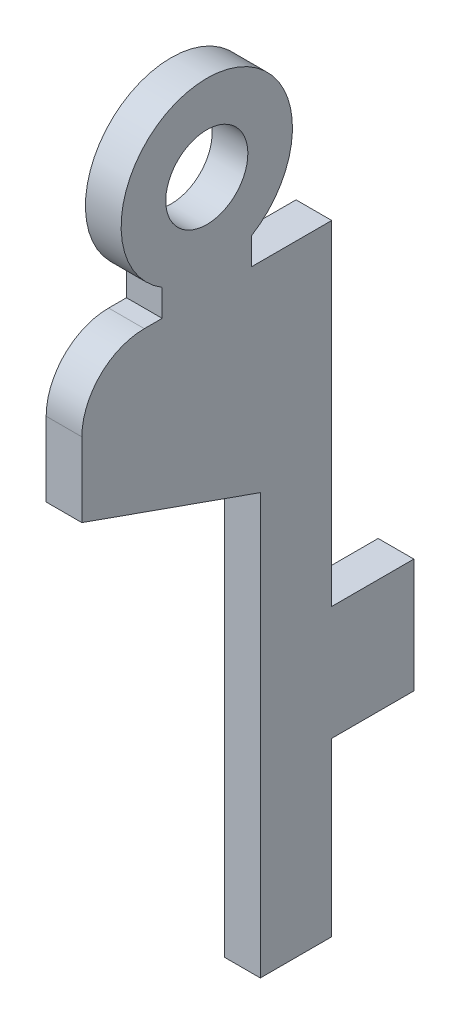
ISO-10303-21;
HEADER;
FILE_DESCRIPTION(('STEP AP214'),'2;1');
FILE_NAME('part.step','',(''),(''),'','','');
FILE_SCHEMA(('AUTOMOTIVE_DESIGN { 1 0 10303 214 1 1 1 1 }'));
ENDSEC;
DATA;
#1=APPLICATION_CONTEXT('core data for automotive mechanical design processes');
#2=APPLICATION_PROTOCOL_DEFINITION('international standard','automotive_design',2000,#1);
#3=PRODUCT_CONTEXT('',#1,'mechanical');
#4=PRODUCT('Part','Part','',(#3));
#5=PRODUCT_RELATED_PRODUCT_CATEGORY('part','',(#4));
#6=PRODUCT_DEFINITION_FORMATION('','',#4);
#7=PRODUCT_DEFINITION_CONTEXT('part definition',#1,'design');
#8=PRODUCT_DEFINITION('design','',#6,#7);
#9=PRODUCT_DEFINITION_SHAPE('','',#8);
#10=(LENGTH_UNIT() NAMED_UNIT(*) SI_UNIT(.MILLI.,.METRE.));
#11=(NAMED_UNIT(*) PLANE_ANGLE_UNIT() SI_UNIT($,.RADIAN.));
#12=(NAMED_UNIT(*) SI_UNIT($,.STERADIAN.) SOLID_ANGLE_UNIT());
#13=UNCERTAINTY_MEASURE_WITH_UNIT(LENGTH_MEASURE(1.E-05),#10,'distance_accuracy_value','');
#14=(GEOMETRIC_REPRESENTATION_CONTEXT(3) GLOBAL_UNCERTAINTY_ASSIGNED_CONTEXT((#13)) GLOBAL_UNIT_ASSIGNED_CONTEXT((#10,
#11,#12)) REPRESENTATION_CONTEXT('',''));
#15=CARTESIAN_POINT('',(0.,0.,0.));
#16=DIRECTION('',(0.,0.,1.));
#17=DIRECTION('',(1.,0.,0.));
#18=AXIS2_PLACEMENT_3D('',#15,#16,#17);
#19=CARTESIAN_POINT('',(2.35,8.49175045506222,-7.7));
#20=DIRECTION('',(1.,0.,0.));
#21=DIRECTION('',(0.,1.,0.));
#22=AXIS2_PLACEMENT_3D('',#19,#20,#21);
#23=PLANE('',#22);
#24=CARTESIAN_POINT('',(2.35,17.3808325195312,-6.55));
#25=DIRECTION('',(1.,0.,0.));
#26=DIRECTION('',(0.,1.,0.));
#27=AXIS2_PLACEMENT_3D('',#24,#25,#26);
#28=CIRCLE('',#27,1.15);
#29=CARTESIAN_POINT('',(2.35,16.2308325195312,-6.55));
#30=VERTEX_POINT('',#29);
#31=EDGE_CURVE('E254',#30,#30,#28,.T.);
#32=ORIENTED_EDGE('',*,*,#31,.T.);
#33=EDGE_LOOP('',(#32));
#34=FACE_BOUND('',#33,.T.);
#35=DIRECTION('',(0.,-1.,0.));
#36=VECTOR('',#35,1.);
#37=CARTESIAN_POINT('',(2.35,2.01624877929678,-12.35));
#38=LINE('',#37,#36);
#39=CARTESIAN_POINT('',(2.35,5.21624877929677,-12.35));
#40=VERTEX_POINT('',#39);
#41=CARTESIAN_POINT('',(2.35,2.01624877929678,-12.35));
#42=VERTEX_POINT('',#41);
#43=EDGE_CURVE('E11',#40,#42,#38,.T.);
#44=ORIENTED_EDGE('',*,*,#43,.T.);
#45=DIRECTION('',(0.,0.,1.));
#46=VECTOR('',#45,1.);
#47=CARTESIAN_POINT('',(2.35,2.01624877929678,-12.35));
#48=LINE('',#47,#46);
#49=CARTESIAN_POINT('',(2.35,2.01624877929678,-10.05));
#50=VERTEX_POINT('',#49);
#51=EDGE_CURVE('E169',#42,#50,#48,.T.);
#52=ORIENTED_EDGE('',*,*,#51,.T.);
#53=DIRECTION('',(0.,-1.,0.));
#54=VECTOR('',#53,1.);
#55=CARTESIAN_POINT('',(2.35,2.01624877929678,-10.05));
#56=LINE('',#55,#54);
#57=CARTESIAN_POINT('',(2.35,-2.79733160940674,-10.05));
#58=VERTEX_POINT('',#57);
#59=EDGE_CURVE('E176',#50,#58,#56,.T.);
#60=ORIENTED_EDGE('',*,*,#59,.T.);
#61=DIRECTION('',(0.,0.,1.));
#62=VECTOR('',#61,1.);
#63=CARTESIAN_POINT('',(2.35,-2.79733160940674,-10.05));
#64=LINE('',#63,#62);
#65=CARTESIAN_POINT('',(2.35,-2.79733160940674,-8.05));
#66=VERTEX_POINT('',#65);
#67=EDGE_CURVE('E193',#58,#66,#64,.T.);
#68=ORIENTED_EDGE('',*,*,#67,.T.);
#69=DIRECTION('',(0.,1.,0.));
#70=VECTOR('',#69,1.);
#71=CARTESIAN_POINT('',(2.35,-2.79733160940674,-8.05));
#72=LINE('',#71,#70);
#73=CARTESIAN_POINT('',(2.35,8.97779600691296,-8.05));
#74=VERTEX_POINT('',#73);
#75=EDGE_CURVE('E274',#66,#74,#72,.T.);
#76=ORIENTED_EDGE('',*,*,#75,.T.);
#77=DIRECTION('',(0.,0.334004933719925,0.942571325816115));
#78=VECTOR('',#77,1.);
#79=CARTESIAN_POINT('',(2.35,10.7495713865148,-3.05));
#80=LINE('',#79,#78);
#81=CARTESIAN_POINT('',(2.35,10.7495713865148,-3.05));
#82=VERTEX_POINT('',#81);
#83=EDGE_CURVE('E214',#74,#82,#80,.T.);
#84=ORIENTED_EDGE('',*,*,#83,.T.);
#85=DIRECTION('',(0.,1.,0.));
#86=VECTOR('',#85,1.);
#87=CARTESIAN_POINT('',(2.35,10.7495713865148,-3.05));
#88=LINE('',#87,#86);
#89=CARTESIAN_POINT('',(2.35,12.8308325195312,-3.05));
#90=VERTEX_POINT('',#89);
#91=EDGE_CURVE('E21',#82,#90,#88,.T.);
#92=ORIENTED_EDGE('',*,*,#91,.T.);
#93=CARTESIAN_POINT('',(2.35,12.8308325195312,-4.8));
#94=DIRECTION('',(-1.,0.,0.));
#95=DIRECTION('',(0.,1.,0.));
#96=AXIS2_PLACEMENT_3D('',#93,#94,#95);
#97=CIRCLE('',#96,1.75);
#98=CARTESIAN_POINT('',(2.35,14.5808325195312,-4.8));
#99=VERTEX_POINT('',#98);
#100=EDGE_CURVE('E251',#90,#99,#97,.T.);
#101=ORIENTED_EDGE('',*,*,#100,.T.);
#102=DIRECTION('',(0.,0.,-1.));
#103=VECTOR('',#102,1.);
#104=CARTESIAN_POINT('',(2.35,14.5808325195312,-5.3));
#105=LINE('',#104,#103);
#106=CARTESIAN_POINT('',(2.35,14.5808325195312,-5.3));
#107=VERTEX_POINT('',#106);
#108=EDGE_CURVE('E292',#99,#107,#105,.T.);
#109=ORIENTED_EDGE('',*,*,#108,.T.);
#110=DIRECTION('',(0.,1.,0.));
#111=VECTOR('',#110,1.);
#112=CARTESIAN_POINT('',(2.35,14.5808325195312,-5.3));
#113=LINE('',#112,#111);
#114=CARTESIAN_POINT('',(2.35,15.3320523946764,-5.3));
#115=VERTEX_POINT('',#114);
#116=EDGE_CURVE('E219',#107,#115,#113,.T.);
#117=ORIENTED_EDGE('',*,*,#116,.T.);
#118=CARTESIAN_POINT('',(2.35,17.3808325195312,-6.55));
#119=DIRECTION('',(-1.,0.,0.));
#120=DIRECTION('',(0.,-0.853658385356162,-0.520833333333333));
#121=AXIS2_PLACEMENT_3D('',#118,#119,#120);
#122=CIRCLE('',#121,2.4);
#123=CARTESIAN_POINT('',(2.35,15.3320523946764,-7.8));
#124=VERTEX_POINT('',#123);
#125=EDGE_CURVE('E208',#115,#124,#122,.T.);
#126=ORIENTED_EDGE('',*,*,#125,.T.);
#127=DIRECTION('',(0.,-1.,0.));
#128=VECTOR('',#127,1.);
#129=CARTESIAN_POINT('',(2.35,14.5808325195312,-7.8));
#130=LINE('',#129,#128);
#131=CARTESIAN_POINT('',(2.35,14.5808325195312,-7.8));
#132=VERTEX_POINT('',#131);
#133=EDGE_CURVE('E198',#124,#132,#130,.T.);
#134=ORIENTED_EDGE('',*,*,#133,.T.);
#135=DIRECTION('',(0.,0.,-1.));
#136=VECTOR('',#135,1.);
#137=CARTESIAN_POINT('',(2.35,14.5808325195312,-10.05));
#138=LINE('',#137,#136);
#139=CARTESIAN_POINT('',(2.35,14.5808325195312,-10.05));
#140=VERTEX_POINT('',#139);
#141=EDGE_CURVE('E272',#132,#140,#138,.T.);
#142=ORIENTED_EDGE('',*,*,#141,.T.);
#143=DIRECTION('',(0.,-1.,0.));
#144=VECTOR('',#143,1.);
#145=CARTESIAN_POINT('',(2.35,12.2808325195312,-10.05));
#146=LINE('',#145,#144);
#147=CARTESIAN_POINT('',(2.35,5.21624877929677,-10.05));
#148=VERTEX_POINT('',#147);
#149=EDGE_CURVE('E341',#140,#148,#146,.T.);
#150=ORIENTED_EDGE('',*,*,#149,.T.);
#151=DIRECTION('',(0.,0.,-1.));
#152=VECTOR('',#151,1.);
#153=CARTESIAN_POINT('',(2.35,5.21624877929677,-12.35));
#154=LINE('',#153,#152);
#155=EDGE_CURVE('E285',#148,#40,#154,.T.);
#156=ORIENTED_EDGE('',*,*,#155,.T.);
#157=EDGE_LOOP('',(#44,#52,#60,#68,#76,#84,#92,#101,#109,#117,#126,#134,#142,#150,#156));
#158=FACE_BOUND('',#157,.T.);
#159=ADVANCED_FACE('F17',(#34,#158),#23,.F.);
#160=CARTESIAN_POINT('',(3.35,8.49175045506222,-7.7));
#161=DIRECTION('',(1.,0.,0.));
#162=DIRECTION('',(0.,1.,0.));
#163=AXIS2_PLACEMENT_3D('',#160,#161,#162);
#164=PLANE('',#163);
#165=CARTESIAN_POINT('',(3.35,17.3808325195312,-6.55));
#166=DIRECTION('',(-1.,0.,0.));
#167=DIRECTION('',(0.,1.,0.));
#168=AXIS2_PLACEMENT_3D('',#165,#166,#167);
#169=CIRCLE('',#168,1.15);
#170=CARTESIAN_POINT('',(3.35,16.2308325195312,-6.55));
#171=VERTEX_POINT('',#170);
#172=EDGE_CURVE('E238',#171,#171,#169,.T.);
#173=ORIENTED_EDGE('',*,*,#172,.T.);
#174=EDGE_LOOP('',(#173));
#175=FACE_BOUND('',#174,.T.);
#176=DIRECTION('',(0.,1.,0.));
#177=VECTOR('',#176,1.);
#178=CARTESIAN_POINT('',(3.35,2.01624877929678,-12.35));
#179=LINE('',#178,#177);
#180=CARTESIAN_POINT('',(3.35,2.01624877929678,-12.35));
#181=VERTEX_POINT('',#180);
#182=CARTESIAN_POINT('',(3.35,5.21624877929677,-12.35));
#183=VERTEX_POINT('',#182);
#184=EDGE_CURVE('E28',#181,#183,#179,.T.);
#185=ORIENTED_EDGE('',*,*,#184,.T.);
#186=DIRECTION('',(0.,0.,1.));
#187=VECTOR('',#186,1.);
#188=CARTESIAN_POINT('',(3.35,5.21624877929677,-12.35));
#189=LINE('',#188,#187);
#190=CARTESIAN_POINT('',(3.35,5.21624877929677,-10.05));
#191=VERTEX_POINT('',#190);
#192=EDGE_CURVE('E242',#183,#191,#189,.T.);
#193=ORIENTED_EDGE('',*,*,#192,.T.);
#194=DIRECTION('',(0.,-1.,0.));
#195=VECTOR('',#194,1.);
#196=CARTESIAN_POINT('',(3.35,12.2808325195312,-10.05));
#197=LINE('',#196,#195);
#198=CARTESIAN_POINT('',(3.35,14.5808325195312,-10.05));
#199=VERTEX_POINT('',#198);
#200=EDGE_CURVE('E305',#199,#191,#197,.T.);
#201=ORIENTED_EDGE('',*,*,#200,.F.);
#202=DIRECTION('',(0.,0.,1.));
#203=VECTOR('',#202,1.);
#204=CARTESIAN_POINT('',(3.35,14.5808325195312,-10.05));
#205=LINE('',#204,#203);
#206=CARTESIAN_POINT('',(3.35,14.5808325195312,-7.8));
#207=VERTEX_POINT('',#206);
#208=EDGE_CURVE('E268',#199,#207,#205,.T.);
#209=ORIENTED_EDGE('',*,*,#208,.T.);
#210=DIRECTION('',(0.,1.,0.));
#211=VECTOR('',#210,1.);
#212=CARTESIAN_POINT('',(3.35,14.5808325195312,-7.8));
#213=LINE('',#212,#211);
#214=CARTESIAN_POINT('',(3.35,15.3320523946764,-7.8));
#215=VERTEX_POINT('',#214);
#216=EDGE_CURVE('E202',#207,#215,#213,.T.);
#217=ORIENTED_EDGE('',*,*,#216,.T.);
#218=CARTESIAN_POINT('',(3.35,17.3808325195312,-6.55));
#219=DIRECTION('',(1.,0.,0.));
#220=DIRECTION('',(0.,-0.853658385356162,-0.520833333333333));
#221=AXIS2_PLACEMENT_3D('',#218,#219,#220);
#222=CIRCLE('',#221,2.4);
#223=CARTESIAN_POINT('',(3.35,15.3320523946764,-5.3));
#224=VERTEX_POINT('',#223);
#225=EDGE_CURVE('E215',#215,#224,#222,.T.);
#226=ORIENTED_EDGE('',*,*,#225,.T.);
#227=DIRECTION('',(0.,1.,0.));
#228=VECTOR('',#227,1.);
#229=CARTESIAN_POINT('',(3.35,14.5808325195312,-5.3));
#230=LINE('',#229,#228);
#231=CARTESIAN_POINT('',(3.35,14.5808325195312,-5.3));
#232=VERTEX_POINT('',#231);
#233=EDGE_CURVE('E207',#232,#224,#230,.T.);
#234=ORIENTED_EDGE('',*,*,#233,.F.);
#235=DIRECTION('',(0.,0.,1.));
#236=VECTOR('',#235,1.);
#237=CARTESIAN_POINT('',(3.35,14.5808325195312,-5.3));
#238=LINE('',#237,#236);
#239=CARTESIAN_POINT('',(3.35,14.5808325195312,-4.8));
#240=VERTEX_POINT('',#239);
#241=EDGE_CURVE('E234',#232,#240,#238,.T.);
#242=ORIENTED_EDGE('',*,*,#241,.T.);
#243=CARTESIAN_POINT('',(3.35,12.8308325195312,-4.8));
#244=DIRECTION('',(1.,0.,0.));
#245=DIRECTION('',(0.,1.,0.));
#246=AXIS2_PLACEMENT_3D('',#243,#244,#245);
#247=CIRCLE('',#246,1.75);
#248=CARTESIAN_POINT('',(3.35,12.8308325195312,-3.05));
#249=VERTEX_POINT('',#248);
#250=EDGE_CURVE('E309',#240,#249,#247,.T.);
#251=ORIENTED_EDGE('',*,*,#250,.T.);
#252=DIRECTION('',(0.,1.,0.));
#253=VECTOR('',#252,1.);
#254=CARTESIAN_POINT('',(3.35,10.7495713865148,-3.05));
#255=LINE('',#254,#253);
#256=CARTESIAN_POINT('',(3.35,10.7495713865148,-3.05));
#257=VERTEX_POINT('',#256);
#258=EDGE_CURVE('E250',#257,#249,#255,.T.);
#259=ORIENTED_EDGE('',*,*,#258,.F.);
#260=DIRECTION('',(0.,-0.334004933719925,-0.942571325816115));
#261=VECTOR('',#260,1.);
#262=CARTESIAN_POINT('',(3.35,10.7495713865148,-3.05));
#263=LINE('',#262,#261);
#264=CARTESIAN_POINT('',(3.35,8.97779600691296,-8.05));
#265=VERTEX_POINT('',#264);
#266=EDGE_CURVE('E267',#257,#265,#263,.T.);
#267=ORIENTED_EDGE('',*,*,#266,.T.);
#268=DIRECTION('',(0.,1.,0.));
#269=VECTOR('',#268,1.);
#270=CARTESIAN_POINT('',(3.35,-2.79733160940674,-8.05));
#271=LINE('',#270,#269);
#272=CARTESIAN_POINT('',(3.35,-2.79733160940674,-8.05));
#273=VERTEX_POINT('',#272);
#274=EDGE_CURVE('E213',#273,#265,#271,.T.);
#275=ORIENTED_EDGE('',*,*,#274,.F.);
#276=DIRECTION('',(0.,0.,1.));
#277=VECTOR('',#276,1.);
#278=CARTESIAN_POINT('',(3.35,-2.79733160940674,-10.05));
#279=LINE('',#278,#277);
#280=CARTESIAN_POINT('',(3.35,-2.79733160940674,-10.05));
#281=VERTEX_POINT('',#280);
#282=EDGE_CURVE('E182',#281,#273,#279,.T.);
#283=ORIENTED_EDGE('',*,*,#282,.F.);
#284=DIRECTION('',(0.,-1.,0.));
#285=VECTOR('',#284,1.);
#286=CARTESIAN_POINT('',(3.35,2.01624877929678,-10.05));
#287=LINE('',#286,#285);
#288=CARTESIAN_POINT('',(3.35,2.01624877929678,-10.05));
#289=VERTEX_POINT('',#288);
#290=EDGE_CURVE('E174',#289,#281,#287,.T.);
#291=ORIENTED_EDGE('',*,*,#290,.F.);
#292=DIRECTION('',(0.,0.,1.));
#293=VECTOR('',#292,1.);
#294=CARTESIAN_POINT('',(3.35,2.01624877929678,-12.35));
#295=LINE('',#294,#293);
#296=EDGE_CURVE('E159',#181,#289,#295,.T.);
#297=ORIENTED_EDGE('',*,*,#296,.F.);
#298=EDGE_LOOP('',(#185,#193,#201,#209,#217,#226,#234,#242,#251,#259,#267,#275,#283,#291,#297));
#299=FACE_BOUND('',#298,.T.);
#300=ADVANCED_FACE('F180',(#175,#299),#164,.T.);
#301=CARTESIAN_POINT('',(3.35,5.21624877929677,-12.35));
#302=DIRECTION('',(0.,0.,-1.));
#303=DIRECTION('',(0.,-1.,0.));
#304=AXIS2_PLACEMENT_3D('',#301,#302,#303);
#305=PLANE('',#304);
#306=ORIENTED_EDGE('',*,*,#184,.F.);
#307=DIRECTION('',(-1.,0.,0.));
#308=VECTOR('',#307,1.);
#309=CARTESIAN_POINT('',(3.35,2.01624877929678,-12.35));
#310=LINE('',#309,#308);
#311=EDGE_CURVE('E165',#181,#42,#310,.T.);
#312=ORIENTED_EDGE('',*,*,#311,.T.);
#313=ORIENTED_EDGE('',*,*,#43,.F.);
#314=DIRECTION('',(-1.,0.,0.));
#315=VECTOR('',#314,1.);
#316=CARTESIAN_POINT('',(3.35,5.21624877929677,-12.35));
#317=LINE('',#316,#315);
#318=EDGE_CURVE('E289',#183,#40,#317,.T.);
#319=ORIENTED_EDGE('',*,*,#318,.F.);
#320=EDGE_LOOP('',(#306,#312,#313,#319));
#321=FACE_BOUND('',#320,.T.);
#322=ADVANCED_FACE('F384',(#321),#305,.T.);
#323=CARTESIAN_POINT('',(3.35,2.01624877929678,-12.35));
#324=DIRECTION('',(0.,-1.,0.));
#325=DIRECTION('',(0.,0.,-1.));
#326=AXIS2_PLACEMENT_3D('',#323,#324,#325);
#327=PLANE('',#326);
#328=ORIENTED_EDGE('',*,*,#296,.T.);
#329=DIRECTION('',(-1.,0.,0.));
#330=VECTOR('',#329,1.);
#331=CARTESIAN_POINT('',(3.35,2.01624877929678,-10.05));
#332=LINE('',#331,#330);
#333=EDGE_CURVE('E163',#289,#50,#332,.T.);
#334=ORIENTED_EDGE('',*,*,#333,.T.);
#335=ORIENTED_EDGE('',*,*,#51,.F.);
#336=ORIENTED_EDGE('',*,*,#311,.F.);
#337=EDGE_LOOP('',(#328,#334,#335,#336));
#338=FACE_BOUND('',#337,.T.);
#339=ADVANCED_FACE('F161',(#338),#327,.T.);
#340=CARTESIAN_POINT('',(3.35,2.01624877929678,-10.05));
#341=DIRECTION('',(0.,0.,-1.));
#342=DIRECTION('',(0.,-1.,0.));
#343=AXIS2_PLACEMENT_3D('',#340,#341,#342);
#344=PLANE('',#343);
#345=ORIENTED_EDGE('',*,*,#290,.T.);
#346=DIRECTION('',(-1.,0.,0.));
#347=VECTOR('',#346,1.);
#348=CARTESIAN_POINT('',(3.35,-2.79733160940674,-10.05));
#349=LINE('',#348,#347);
#350=EDGE_CURVE('E184',#281,#58,#349,.T.);
#351=ORIENTED_EDGE('',*,*,#350,.T.);
#352=ORIENTED_EDGE('',*,*,#59,.F.);
#353=ORIENTED_EDGE('',*,*,#333,.F.);
#354=EDGE_LOOP('',(#345,#351,#352,#353));
#355=FACE_BOUND('',#354,.T.);
#356=ADVANCED_FACE('F172',(#355),#344,.T.);
#357=CARTESIAN_POINT('',(3.35,-2.79733160940674,-10.05));
#358=DIRECTION('',(0.,-1.,0.));
#359=DIRECTION('',(0.,0.,-1.));
#360=AXIS2_PLACEMENT_3D('',#357,#358,#359);
#361=PLANE('',#360);
#362=ORIENTED_EDGE('',*,*,#282,.T.);
#363=DIRECTION('',(-1.,0.,0.));
#364=VECTOR('',#363,1.);
#365=CARTESIAN_POINT('',(3.35,-2.79733160940674,-8.05));
#366=LINE('',#365,#364);
#367=EDGE_CURVE('E276',#273,#66,#366,.T.);
#368=ORIENTED_EDGE('',*,*,#367,.T.);
#369=ORIENTED_EDGE('',*,*,#67,.F.);
#370=ORIENTED_EDGE('',*,*,#350,.F.);
#371=EDGE_LOOP('',(#362,#368,#369,#370));
#372=FACE_BOUND('',#371,.T.);
#373=ADVANCED_FACE('F387',(#372),#361,.T.);
#374=CARTESIAN_POINT('',(3.35,-2.79733160940674,-8.05));
#375=DIRECTION('',(0.,0.,1.));
#376=DIRECTION('',(0.,-1.,0.));
#377=AXIS2_PLACEMENT_3D('',#374,#375,#376);
#378=PLANE('',#377);
#379=ORIENTED_EDGE('',*,*,#274,.T.);
#380=DIRECTION('',(-1.,0.,0.));
#381=VECTOR('',#380,1.);
#382=CARTESIAN_POINT('',(3.35,8.97779600691296,-8.05));
#383=LINE('',#382,#381);
#384=EDGE_CURVE('E209',#265,#74,#383,.T.);
#385=ORIENTED_EDGE('',*,*,#384,.T.);
#386=ORIENTED_EDGE('',*,*,#75,.F.);
#387=ORIENTED_EDGE('',*,*,#367,.F.);
#388=EDGE_LOOP('',(#379,#385,#386,#387));
#389=FACE_BOUND('',#388,.T.);
#390=ADVANCED_FACE('F392',(#389),#378,.T.);
#391=CARTESIAN_POINT('',(3.35,8.97779600691296,-8.05));
#392=DIRECTION('',(0.,-0.942571325816115,0.334004933719925));
#393=DIRECTION('',(-1.,0.,0.));
#394=AXIS2_PLACEMENT_3D('',#391,#392,#393);
#395=PLANE('',#394);
#396=ORIENTED_EDGE('',*,*,#266,.F.);
#397=DIRECTION('',(-1.,0.,0.));
#398=VECTOR('',#397,1.);
#399=CARTESIAN_POINT('',(3.35,10.7495713865148,-3.05));
#400=LINE('',#399,#398);
#401=EDGE_CURVE('E263',#257,#82,#400,.T.);
#402=ORIENTED_EDGE('',*,*,#401,.T.);
#403=ORIENTED_EDGE('',*,*,#83,.F.);
#404=ORIENTED_EDGE('',*,*,#384,.F.);
#405=EDGE_LOOP('',(#396,#402,#403,#404));
#406=FACE_BOUND('',#405,.T.);
#407=ADVANCED_FACE('F19',(#406),#395,.T.);
#408=CARTESIAN_POINT('',(3.35,10.7495713865148,-3.05));
#409=DIRECTION('',(0.,0.,1.));
#410=DIRECTION('',(1.,0.,0.));
#411=AXIS2_PLACEMENT_3D('',#408,#409,#410);
#412=PLANE('',#411);
#413=ORIENTED_EDGE('',*,*,#258,.T.);
#414=DIRECTION('',(-1.,0.,0.));
#415=VECTOR('',#414,1.);
#416=CARTESIAN_POINT('',(3.35,12.8308325195312,-3.05));
#417=LINE('',#416,#415);
#418=EDGE_CURVE('E246',#249,#90,#417,.T.);
#419=ORIENTED_EDGE('',*,*,#418,.T.);
#420=ORIENTED_EDGE('',*,*,#91,.F.);
#421=ORIENTED_EDGE('',*,*,#401,.F.);
#422=EDGE_LOOP('',(#413,#419,#420,#421));
#423=FACE_BOUND('',#422,.T.);
#424=ADVANCED_FACE('F357',(#423),#412,.T.);
#425=CARTESIAN_POINT('',(3.35,12.8308325195312,-4.8));
#426=DIRECTION('',(-1.,0.,0.));
#427=DIRECTION('',(0.,1.,0.));
#428=AXIS2_PLACEMENT_3D('',#425,#426,#427);
#429=CYLINDRICAL_SURFACE('',#428,1.75);
#430=ORIENTED_EDGE('',*,*,#250,.F.);
#431=DIRECTION('',(-1.,0.,0.));
#432=VECTOR('',#431,1.);
#433=CARTESIAN_POINT('',(3.35,14.5808325195312,-4.8));
#434=LINE('',#433,#432);
#435=EDGE_CURVE('E306',#240,#99,#434,.T.);
#436=ORIENTED_EDGE('',*,*,#435,.T.);
#437=ORIENTED_EDGE('',*,*,#100,.F.);
#438=ORIENTED_EDGE('',*,*,#418,.F.);
#439=EDGE_LOOP('',(#430,#436,#437,#438));
#440=FACE_BOUND('',#439,.T.);
#441=ADVANCED_FACE('F353',(#440),#429,.T.);
#442=CARTESIAN_POINT('',(3.35,14.5808325195312,-4.8));
#443=DIRECTION('',(0.,1.,0.));
#444=DIRECTION('',(1.,0.,0.));
#445=AXIS2_PLACEMENT_3D('',#442,#443,#444);
#446=PLANE('',#445);
#447=ORIENTED_EDGE('',*,*,#241,.F.);
#448=DIRECTION('',(-1.,0.,0.));
#449=VECTOR('',#448,1.);
#450=CARTESIAN_POINT('',(3.35,14.5808325195312,-5.3));
#451=LINE('',#450,#449);
#452=EDGE_CURVE('E227',#232,#107,#451,.T.);
#453=ORIENTED_EDGE('',*,*,#452,.T.);
#454=ORIENTED_EDGE('',*,*,#108,.F.);
#455=ORIENTED_EDGE('',*,*,#435,.F.);
#456=EDGE_LOOP('',(#447,#453,#454,#455));
#457=FACE_BOUND('',#456,.T.);
#458=ADVANCED_FACE('F350',(#457),#446,.T.);
#459=CARTESIAN_POINT('',(3.35,14.5808325195312,-5.3));
#460=DIRECTION('',(0.,0.,1.));
#461=DIRECTION('',(1.,0.,0.));
#462=AXIS2_PLACEMENT_3D('',#459,#460,#461);
#463=PLANE('',#462);
#464=ORIENTED_EDGE('',*,*,#233,.T.);
#465=DIRECTION('',(-1.,0.,0.));
#466=VECTOR('',#465,1.);
#467=CARTESIAN_POINT('',(3.35,15.3320523946764,-5.3));
#468=LINE('',#467,#466);
#469=EDGE_CURVE('E203',#224,#115,#468,.T.);
#470=ORIENTED_EDGE('',*,*,#469,.T.);
#471=ORIENTED_EDGE('',*,*,#116,.F.);
#472=ORIENTED_EDGE('',*,*,#452,.F.);
#473=EDGE_LOOP('',(#464,#470,#471,#472));
#474=FACE_BOUND('',#473,.T.);
#475=ADVANCED_FACE('F345',(#474),#463,.T.);
#476=CARTESIAN_POINT('',(3.35,17.3808325195312,-6.55));
#477=DIRECTION('',(-1.,0.,0.));
#478=DIRECTION('',(0.,1.,0.));
#479=AXIS2_PLACEMENT_3D('',#476,#477,#478);
#480=CYLINDRICAL_SURFACE('',#479,2.4);
#481=ORIENTED_EDGE('',*,*,#225,.F.);
#482=DIRECTION('',(-1.,0.,0.));
#483=VECTOR('',#482,1.);
#484=CARTESIAN_POINT('',(3.35,15.3320523946764,-7.8));
#485=LINE('',#484,#483);
#486=EDGE_CURVE('E201',#215,#124,#485,.T.);
#487=ORIENTED_EDGE('',*,*,#486,.T.);
#488=ORIENTED_EDGE('',*,*,#125,.F.);
#489=ORIENTED_EDGE('',*,*,#469,.F.);
#490=EDGE_LOOP('',(#481,#487,#488,#489));
#491=FACE_BOUND('',#490,.T.);
#492=ADVANCED_FACE('F344',(#491),#480,.T.);
#493=CARTESIAN_POINT('',(3.35,15.3320523946764,-7.8));
#494=DIRECTION('',(0.,0.,-1.));
#495=DIRECTION('',(0.,-1.,0.));
#496=AXIS2_PLACEMENT_3D('',#493,#494,#495);
#497=PLANE('',#496);
#498=ORIENTED_EDGE('',*,*,#216,.F.);
#499=DIRECTION('',(-1.,0.,0.));
#500=VECTOR('',#499,1.);
#501=CARTESIAN_POINT('',(3.35,14.5808325195312,-7.8));
#502=LINE('',#501,#500);
#503=EDGE_CURVE('E312',#207,#132,#502,.T.);
#504=ORIENTED_EDGE('',*,*,#503,.T.);
#505=ORIENTED_EDGE('',*,*,#133,.F.);
#506=ORIENTED_EDGE('',*,*,#486,.F.);
#507=EDGE_LOOP('',(#498,#504,#505,#506));
#508=FACE_BOUND('',#507,.T.);
#509=ADVANCED_FACE('F333',(#508),#497,.T.);
#510=CARTESIAN_POINT('',(3.35,14.5808325195312,-7.8));
#511=DIRECTION('',(0.,1.,0.));
#512=DIRECTION('',(1.,0.,0.));
#513=AXIS2_PLACEMENT_3D('',#510,#511,#512);
#514=PLANE('',#513);
#515=ORIENTED_EDGE('',*,*,#208,.F.);
#516=DIRECTION('',(-1.,0.,0.));
#517=VECTOR('',#516,1.);
#518=CARTESIAN_POINT('',(3.35,14.5808325195312,-10.05));
#519=LINE('',#518,#517);
#520=EDGE_CURVE('E273',#199,#140,#519,.T.);
#521=ORIENTED_EDGE('',*,*,#520,.T.);
#522=ORIENTED_EDGE('',*,*,#141,.F.);
#523=ORIENTED_EDGE('',*,*,#503,.F.);
#524=EDGE_LOOP('',(#515,#521,#522,#523));
#525=FACE_BOUND('',#524,.T.);
#526=ADVANCED_FACE('F337',(#525),#514,.T.);
#527=CARTESIAN_POINT('',(3.35,14.5808325195312,-10.05));
#528=DIRECTION('',(0.,0.,-1.));
#529=DIRECTION('',(0.,-1.,0.));
#530=AXIS2_PLACEMENT_3D('',#527,#528,#529);
#531=PLANE('',#530);
#532=ORIENTED_EDGE('',*,*,#200,.T.);
#533=DIRECTION('',(-1.,0.,0.));
#534=VECTOR('',#533,1.);
#535=CARTESIAN_POINT('',(3.35,5.21624877929677,-10.05));
#536=LINE('',#535,#534);
#537=EDGE_CURVE('E288',#191,#148,#536,.T.);
#538=ORIENTED_EDGE('',*,*,#537,.T.);
#539=ORIENTED_EDGE('',*,*,#149,.F.);
#540=ORIENTED_EDGE('',*,*,#520,.F.);
#541=EDGE_LOOP('',(#532,#538,#539,#540));
#542=FACE_BOUND('',#541,.T.);
#543=ADVANCED_FACE('F377',(#542),#531,.T.);
#544=CARTESIAN_POINT('',(3.35,5.21624877929677,-10.05));
#545=DIRECTION('',(0.,1.,0.));
#546=DIRECTION('',(1.,0.,0.));
#547=AXIS2_PLACEMENT_3D('',#544,#545,#546);
#548=PLANE('',#547);
#549=ORIENTED_EDGE('',*,*,#192,.F.);
#550=ORIENTED_EDGE('',*,*,#318,.T.);
#551=ORIENTED_EDGE('',*,*,#155,.F.);
#552=ORIENTED_EDGE('',*,*,#537,.F.);
#553=EDGE_LOOP('',(#549,#550,#551,#552));
#554=FACE_BOUND('',#553,.T.);
#555=ADVANCED_FACE('F381',(#554),#548,.T.);
#556=CARTESIAN_POINT('',(3.35,17.3808325195312,-6.55));
#557=DIRECTION('',(-1.,0.,0.));
#558=DIRECTION('',(0.,1.,0.));
#559=AXIS2_PLACEMENT_3D('',#556,#557,#558);
#560=CYLINDRICAL_SURFACE('',#559,1.15);
#561=ORIENTED_EDGE('',*,*,#31,.F.);
#562=DIRECTION('',(1.,0.,0.));
#563=VECTOR('',#562,1.);
#564=CARTESIAN_POINT('',(3.35,16.2308325195312,-6.55));
#565=LINE('',#564,#563);
#566=EDGE_CURVE('E243',#30,#171,#565,.T.);
#567=ORIENTED_EDGE('',*,*,#566,.T.);
#568=ORIENTED_EDGE('',*,*,#172,.F.);
#569=ORIENTED_EDGE('',*,*,#566,.F.);
#570=EDGE_LOOP('',(#561,#567,#568,#569));
#571=FACE_BOUND('',#570,.T.);
#572=ADVANCED_FACE('F424',(#571),#560,.F.);
#573=CLOSED_SHELL('',(#159,#300,#322,#339,#356,#373,#390,#407,#424,#441,#458,#475,#492,#509,
#526,#543,#555,#572));
#574=MANIFOLD_SOLID_BREP('B1',#573);
#575=ADVANCED_BREP_SHAPE_REPRESENTATION('',(#18,#574),#14);
#576=SHAPE_DEFINITION_REPRESENTATION(#9,#575);
ENDSEC;
END-ISO-10303-21;
